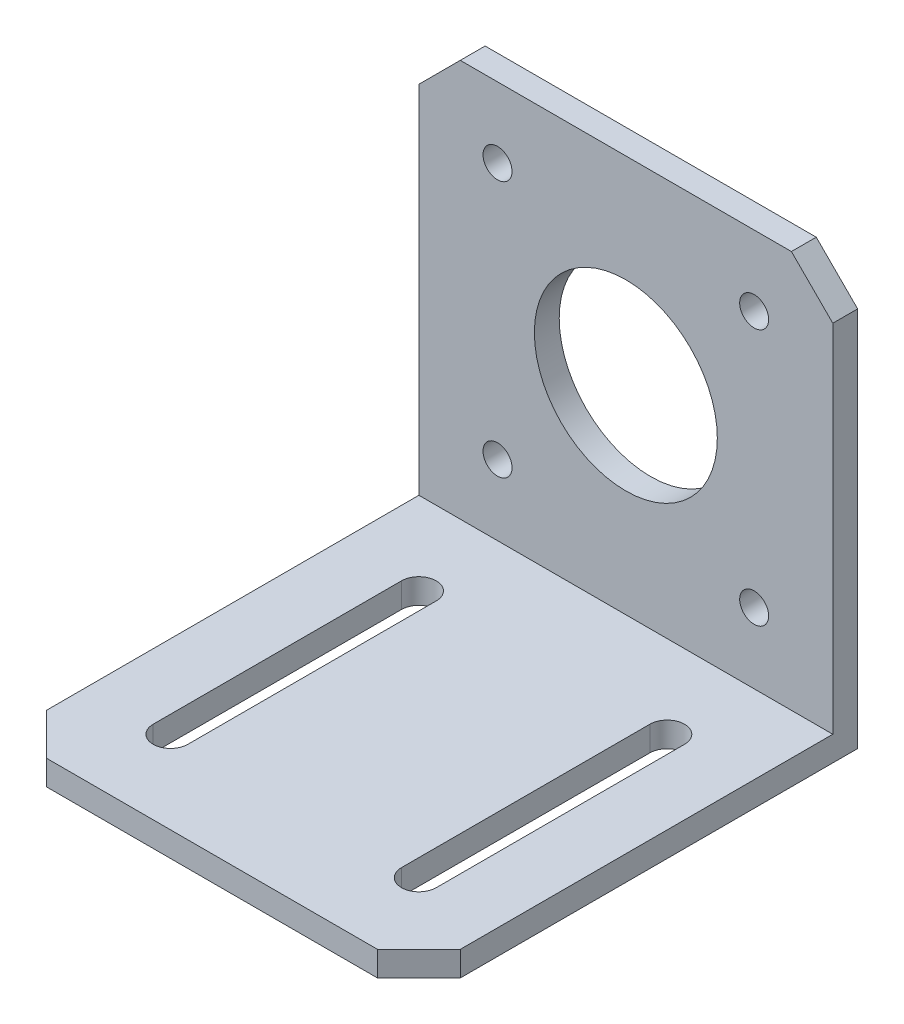
ISO-10303-21;
HEADER;
FILE_DESCRIPTION(('STEP AP214'),'2;1');
FILE_NAME('part.step','',(''),(''),'','','');
FILE_SCHEMA(('AUTOMOTIVE_DESIGN { 1 0 10303 214 1 1 1 1 }'));
ENDSEC;
DATA;
#1=APPLICATION_CONTEXT('core data for automotive mechanical design processes');
#2=APPLICATION_PROTOCOL_DEFINITION('international standard','automotive_design',2000,#1);
#3=PRODUCT_CONTEXT('',#1,'mechanical');
#4=PRODUCT('Part','Part','',(#3));
#5=PRODUCT_RELATED_PRODUCT_CATEGORY('part','',(#4));
#6=PRODUCT_DEFINITION_FORMATION('','',#4);
#7=PRODUCT_DEFINITION_CONTEXT('part definition',#1,'design');
#8=PRODUCT_DEFINITION('design','',#6,#7);
#9=PRODUCT_DEFINITION_SHAPE('','',#8);
#10=(LENGTH_UNIT() NAMED_UNIT(*) SI_UNIT(.MILLI.,.METRE.));
#11=(NAMED_UNIT(*) PLANE_ANGLE_UNIT() SI_UNIT($,.RADIAN.));
#12=(NAMED_UNIT(*) SI_UNIT($,.STERADIAN.) SOLID_ANGLE_UNIT());
#13=UNCERTAINTY_MEASURE_WITH_UNIT(LENGTH_MEASURE(1.E-05),#10,'distance_accuracy_value','');
#14=(GEOMETRIC_REPRESENTATION_CONTEXT(3) GLOBAL_UNCERTAINTY_ASSIGNED_CONTEXT((#13)) GLOBAL_UNIT_ASSIGNED_CONTEXT((#10,
#11,#12)) REPRESENTATION_CONTEXT('',''));
#15=CARTESIAN_POINT('',(0.,0.,0.));
#16=DIRECTION('',(0.,0.,1.));
#17=DIRECTION('',(1.,0.,0.));
#18=AXIS2_PLACEMENT_3D('',#15,#16,#17);
#19=CARTESIAN_POINT('',(-50.,0.,-53.));
#20=DIRECTION('',(0.,-1.,0.));
#21=DIRECTION('',(0.,0.,-1.));
#22=AXIS2_PLACEMENT_3D('',#19,#20,#21);
#23=PLANE('',#22);
#24=CARTESIAN_POINT('',(-40.,0.,-40.));
#25=DIRECTION('',(0.,-1.,0.));
#26=DIRECTION('',(0.,0.,-1.));
#27=AXIS2_PLACEMENT_3D('',#24,#25,#26);
#28=CIRCLE('',#27,2.1);
#29=CARTESIAN_POINT('',(-37.9,0.,-40.));
#30=VERTEX_POINT('',#29);
#31=CARTESIAN_POINT('',(-42.1,0.,-40.));
#32=VERTEX_POINT('',#31);
#33=EDGE_CURVE('E183',#30,#32,#28,.F.);
#34=ORIENTED_EDGE('',*,*,#33,.T.);
#35=DIRECTION('',(0.,0.,1.));
#36=VECTOR('',#35,1.);
#37=CARTESIAN_POINT('',(-42.1,0.,-40.));
#38=LINE('',#37,#36);
#39=CARTESIAN_POINT('',(-42.1,0.,-9.99999999999998));
#40=VERTEX_POINT('',#39);
#41=EDGE_CURVE('E167',#32,#40,#38,.T.);
#42=ORIENTED_EDGE('',*,*,#41,.T.);
#43=CARTESIAN_POINT('',(-40.,0.,-9.99999999999999));
#44=DIRECTION('',(0.,-1.,0.));
#45=DIRECTION('',(0.,0.,-1.));
#46=AXIS2_PLACEMENT_3D('',#43,#44,#45);
#47=CIRCLE('',#46,2.1);
#48=CARTESIAN_POINT('',(-37.9,0.,-9.99999999999998));
#49=VERTEX_POINT('',#48);
#50=EDGE_CURVE('E195',#40,#49,#47,.F.);
#51=ORIENTED_EDGE('',*,*,#50,.T.);
#52=DIRECTION('',(0.,0.,-1.));
#53=VECTOR('',#52,1.);
#54=CARTESIAN_POINT('',(-37.9,0.,-40.));
#55=LINE('',#54,#53);
#56=EDGE_CURVE('E191',#49,#30,#55,.T.);
#57=ORIENTED_EDGE('',*,*,#56,.T.);
#58=EDGE_LOOP('',(#34,#42,#51,#57));
#59=FACE_BOUND('',#58,.T.);
#60=CARTESIAN_POINT('',(-10.,0.,-40.));
#61=DIRECTION('',(0.,-1.,0.));
#62=DIRECTION('',(0.,0.,-1.));
#63=AXIS2_PLACEMENT_3D('',#60,#61,#62);
#64=CIRCLE('',#63,2.1);
#65=CARTESIAN_POINT('',(-7.90000000000001,0.,-40.));
#66=VERTEX_POINT('',#65);
#67=CARTESIAN_POINT('',(-12.1,0.,-40.));
#68=VERTEX_POINT('',#67);
#69=EDGE_CURVE('E232',#66,#68,#64,.F.);
#70=ORIENTED_EDGE('',*,*,#69,.T.);
#71=DIRECTION('',(0.,0.,1.));
#72=VECTOR('',#71,1.);
#73=CARTESIAN_POINT('',(-12.1,0.,-40.));
#74=LINE('',#73,#72);
#75=CARTESIAN_POINT('',(-12.1,0.,-9.99999999999999));
#76=VERTEX_POINT('',#75);
#77=EDGE_CURVE('E209',#68,#76,#74,.T.);
#78=ORIENTED_EDGE('',*,*,#77,.T.);
#79=CARTESIAN_POINT('',(-10.,0.,-9.99999999999999));
#80=DIRECTION('',(0.,-1.,0.));
#81=DIRECTION('',(0.,0.,-1.));
#82=AXIS2_PLACEMENT_3D('',#79,#80,#81);
#83=CIRCLE('',#82,2.1);
#84=CARTESIAN_POINT('',(-7.9,0.,-9.99999999999998));
#85=VERTEX_POINT('',#84);
#86=EDGE_CURVE('E238',#76,#85,#83,.F.);
#87=ORIENTED_EDGE('',*,*,#86,.T.);
#88=DIRECTION('',(0.,0.,-1.));
#89=VECTOR('',#88,1.);
#90=CARTESIAN_POINT('',(-7.90000000000001,0.,-40.));
#91=LINE('',#90,#89);
#92=EDGE_CURVE('E235',#85,#66,#91,.T.);
#93=ORIENTED_EDGE('',*,*,#92,.T.);
#94=EDGE_LOOP('',(#70,#78,#87,#93));
#95=FACE_BOUND('',#94,.T.);
#96=DIRECTION('',(0.,0.,-1.));
#97=VECTOR('',#96,1.);
#98=CARTESIAN_POINT('',(0.,0.,-53.));
#99=LINE('',#98,#97);
#100=CARTESIAN_POINT('',(0.,0.,-5.));
#101=VERTEX_POINT('',#100);
#102=CARTESIAN_POINT('',(0.,0.,-53.));
#103=VERTEX_POINT('',#102);
#104=EDGE_CURVE('E268',#101,#103,#99,.T.);
#105=ORIENTED_EDGE('',*,*,#104,.F.);
#106=DIRECTION('',(-0.707106781186549,0.,0.707106781186547));
#107=VECTOR('',#106,1.);
#108=CARTESIAN_POINT('',(-1.00000000000006,0.,-3.99999999999992));
#109=LINE('',#108,#107);
#110=CARTESIAN_POINT('',(-5.00000000000002,0.,0.));
#111=VERTEX_POINT('',#110);
#112=EDGE_CURVE('E330',#101,#111,#109,.T.);
#113=ORIENTED_EDGE('',*,*,#112,.T.);
#114=DIRECTION('',(1.,0.,0.));
#115=VECTOR('',#114,1.);
#116=CARTESIAN_POINT('',(-50.,0.,0.));
#117=LINE('',#116,#115);
#118=CARTESIAN_POINT('',(-45.,0.,0.));
#119=VERTEX_POINT('',#118);
#120=EDGE_CURVE('E290',#119,#111,#117,.T.);
#121=ORIENTED_EDGE('',*,*,#120,.F.);
#122=DIRECTION('',(0.707106781186547,0.,0.707106781186549));
#123=VECTOR('',#122,1.);
#124=CARTESIAN_POINT('',(-74.,0.,-29.0000000000001));
#125=LINE('',#124,#123);
#126=CARTESIAN_POINT('',(-50.,0.,-5.00000000000003));
#127=VERTEX_POINT('',#126);
#128=EDGE_CURVE('E328',#119,#127,#125,.F.);
#129=ORIENTED_EDGE('',*,*,#128,.T.);
#130=DIRECTION('',(0.,0.,-1.));
#131=VECTOR('',#130,1.);
#132=CARTESIAN_POINT('',(-50.,0.,-53.));
#133=LINE('',#132,#131);
#134=CARTESIAN_POINT('',(-50.,0.,-53.));
#135=VERTEX_POINT('',#134);
#136=EDGE_CURVE('E271',#127,#135,#133,.T.);
#137=ORIENTED_EDGE('',*,*,#136,.T.);
#138=DIRECTION('',(1.,0.,0.));
#139=VECTOR('',#138,1.);
#140=CARTESIAN_POINT('',(-50.,0.,-53.));
#141=LINE('',#140,#139);
#142=EDGE_CURVE('E281',#135,#103,#141,.T.);
#143=ORIENTED_EDGE('',*,*,#142,.T.);
#144=EDGE_LOOP('',(#105,#113,#121,#129,#137,#143));
#145=FACE_BOUND('',#144,.T.);
#146=ADVANCED_FACE('F41',(#59,#95,#145),#23,.T.);
#147=CARTESIAN_POINT('',(-50.,0.,0.));
#148=DIRECTION('',(0.,0.,1.));
#149=DIRECTION('',(1.,0.,0.));
#150=AXIS2_PLACEMENT_3D('',#147,#148,#149);
#151=PLANE('',#150);
#152=ORIENTED_EDGE('',*,*,#120,.T.);
#153=DIRECTION('',(0.,1.,0.));
#154=VECTOR('',#153,1.);
#155=CARTESIAN_POINT('',(-5.00000000000002,3.,0.));
#156=LINE('',#155,#154);
#157=CARTESIAN_POINT('',(-5.00000000000002,3.,0.));
#158=VERTEX_POINT('',#157);
#159=EDGE_CURVE('E57',#111,#158,#156,.T.);
#160=ORIENTED_EDGE('',*,*,#159,.T.);
#161=DIRECTION('',(1.,0.,0.));
#162=VECTOR('',#161,1.);
#163=CARTESIAN_POINT('',(-50.,3.,0.));
#164=LINE('',#163,#162);
#165=CARTESIAN_POINT('',(-45.,3.,0.));
#166=VERTEX_POINT('',#165);
#167=EDGE_CURVE('E293',#166,#158,#164,.T.);
#168=ORIENTED_EDGE('',*,*,#167,.F.);
#169=DIRECTION('',(0.,-1.,0.));
#170=VECTOR('',#169,1.);
#171=CARTESIAN_POINT('',(-45.,0.,0.));
#172=LINE('',#171,#170);
#173=EDGE_CURVE('E332',#166,#119,#172,.T.);
#174=ORIENTED_EDGE('',*,*,#173,.T.);
#175=EDGE_LOOP('',(#152,#160,#168,#174));
#176=FACE_BOUND('',#175,.T.);
#177=ADVANCED_FACE('F337',(#176),#151,.T.);
#178=CARTESIAN_POINT('',(-50.,3.,0.));
#179=DIRECTION('',(0.,1.,0.));
#180=DIRECTION('',(0.,0.,1.));
#181=AXIS2_PLACEMENT_3D('',#178,#179,#180);
#182=PLANE('',#181);
#183=CARTESIAN_POINT('',(-40.,3.,-40.));
#184=DIRECTION('',(0.,1.,0.));
#185=DIRECTION('',(0.,0.,1.));
#186=AXIS2_PLACEMENT_3D('',#183,#184,#185);
#187=CIRCLE('',#186,2.1);
#188=CARTESIAN_POINT('',(-37.9,3.,-40.));
#189=VERTEX_POINT('',#188);
#190=CARTESIAN_POINT('',(-42.1,3.,-40.));
#191=VERTEX_POINT('',#190);
#192=EDGE_CURVE('E186',#189,#191,#187,.T.);
#193=ORIENTED_EDGE('',*,*,#192,.F.);
#194=DIRECTION('',(0.,0.,-1.));
#195=VECTOR('',#194,1.);
#196=CARTESIAN_POINT('',(-37.9,3.,-40.));
#197=LINE('',#196,#195);
#198=CARTESIAN_POINT('',(-37.9,3.,-9.99999999999998));
#199=VERTEX_POINT('',#198);
#200=EDGE_CURVE('E187',#199,#189,#197,.T.);
#201=ORIENTED_EDGE('',*,*,#200,.F.);
#202=CARTESIAN_POINT('',(-40.,3.,-9.99999999999999));
#203=DIRECTION('',(0.,1.,0.));
#204=DIRECTION('',(0.,0.,1.));
#205=AXIS2_PLACEMENT_3D('',#202,#203,#204);
#206=CIRCLE('',#205,2.1);
#207=CARTESIAN_POINT('',(-42.1,3.,-9.99999999999998));
#208=VERTEX_POINT('',#207);
#209=EDGE_CURVE('E200',#208,#199,#206,.T.);
#210=ORIENTED_EDGE('',*,*,#209,.F.);
#211=DIRECTION('',(0.,0.,1.));
#212=VECTOR('',#211,1.);
#213=CARTESIAN_POINT('',(-42.1,3.,-40.));
#214=LINE('',#213,#212);
#215=EDGE_CURVE('E193',#191,#208,#214,.T.);
#216=ORIENTED_EDGE('',*,*,#215,.F.);
#217=EDGE_LOOP('',(#193,#201,#210,#216));
#218=FACE_BOUND('',#217,.T.);
#219=CARTESIAN_POINT('',(-10.,3.,-40.));
#220=DIRECTION('',(0.,1.,0.));
#221=DIRECTION('',(0.,0.,-1.));
#222=AXIS2_PLACEMENT_3D('',#219,#220,#221);
#223=CIRCLE('',#222,2.1);
#224=CARTESIAN_POINT('',(-7.90000000000001,3.,-40.));
#225=VERTEX_POINT('',#224);
#226=CARTESIAN_POINT('',(-12.1,3.,-40.));
#227=VERTEX_POINT('',#226);
#228=EDGE_CURVE('E230',#225,#227,#223,.T.);
#229=ORIENTED_EDGE('',*,*,#228,.F.);
#230=DIRECTION('',(0.,0.,-1.));
#231=VECTOR('',#230,1.);
#232=CARTESIAN_POINT('',(-7.90000000000001,3.,-40.));
#233=LINE('',#232,#231);
#234=CARTESIAN_POINT('',(-7.9,3.,-9.99999999999998));
#235=VERTEX_POINT('',#234);
#236=EDGE_CURVE('E216',#235,#225,#233,.T.);
#237=ORIENTED_EDGE('',*,*,#236,.F.);
#238=CARTESIAN_POINT('',(-10.,3.,-9.99999999999999));
#239=DIRECTION('',(0.,1.,0.));
#240=DIRECTION('',(0.,0.,-1.));
#241=AXIS2_PLACEMENT_3D('',#238,#239,#240);
#242=CIRCLE('',#241,2.1);
#243=CARTESIAN_POINT('',(-12.1,3.,-9.99999999999998));
#244=VERTEX_POINT('',#243);
#245=EDGE_CURVE('E224',#244,#235,#242,.T.);
#246=ORIENTED_EDGE('',*,*,#245,.F.);
#247=DIRECTION('',(0.,0.,1.));
#248=VECTOR('',#247,1.);
#249=CARTESIAN_POINT('',(-12.1,3.,-40.));
#250=LINE('',#249,#248);
#251=EDGE_CURVE('E227',#227,#244,#250,.T.);
#252=ORIENTED_EDGE('',*,*,#251,.F.);
#253=EDGE_LOOP('',(#229,#237,#246,#252));
#254=FACE_BOUND('',#253,.T.);
#255=ORIENTED_EDGE('',*,*,#167,.T.);
#256=DIRECTION('',(0.707106781186549,0.,-0.707106781186547));
#257=VECTOR('',#256,1.);
#258=CARTESIAN_POINT('',(-27.5000000000001,3.,22.5));
#259=LINE('',#258,#257);
#260=CARTESIAN_POINT('',(0.,3.,-5.));
#261=VERTEX_POINT('',#260);
#262=EDGE_CURVE('E11',#158,#261,#259,.T.);
#263=ORIENTED_EDGE('',*,*,#262,.T.);
#264=DIRECTION('',(0.,0.,1.));
#265=VECTOR('',#264,1.);
#266=CARTESIAN_POINT('',(0.,3.,0.));
#267=LINE('',#266,#265);
#268=CARTESIAN_POINT('',(0.,3.,-50.));
#269=VERTEX_POINT('',#268);
#270=EDGE_CURVE('E274',#269,#261,#267,.T.);
#271=ORIENTED_EDGE('',*,*,#270,.F.);
#272=DIRECTION('',(1.,0.,0.));
#273=VECTOR('',#272,1.);
#274=CARTESIAN_POINT('',(-50.,3.,-50.));
#275=LINE('',#274,#273);
#276=CARTESIAN_POINT('',(-50.,3.,-50.));
#277=VERTEX_POINT('',#276);
#278=EDGE_CURVE('E295',#277,#269,#275,.T.);
#279=ORIENTED_EDGE('',*,*,#278,.F.);
#280=DIRECTION('',(0.,0.,1.));
#281=VECTOR('',#280,1.);
#282=CARTESIAN_POINT('',(-50.,3.,0.));
#283=LINE('',#282,#281);
#284=CARTESIAN_POINT('',(-50.,3.,-5.00000000000003));
#285=VERTEX_POINT('',#284);
#286=EDGE_CURVE('E279',#277,#285,#283,.T.);
#287=ORIENTED_EDGE('',*,*,#286,.T.);
#288=DIRECTION('',(-0.707106781186547,0.,-0.707106781186549));
#289=VECTOR('',#288,1.);
#290=CARTESIAN_POINT('',(-47.5,3.,-2.50000000000001));
#291=LINE('',#290,#289);
#292=EDGE_CURVE('E50',#285,#166,#291,.F.);
#293=ORIENTED_EDGE('',*,*,#292,.T.);
#294=EDGE_LOOP('',(#255,#263,#271,#279,#287,#293));
#295=FACE_BOUND('',#294,.T.);
#296=ADVANCED_FACE('F351',(#218,#254,#295),#182,.T.);
#297=CARTESIAN_POINT('',(-50.,3.,-50.));
#298=DIRECTION('',(0.,0.,1.));
#299=DIRECTION('',(0.,-1.,0.));
#300=AXIS2_PLACEMENT_3D('',#297,#298,#299);
#301=PLANE('',#300);
#302=CARTESIAN_POINT('',(-40.5,11.5,-50.));
#303=DIRECTION('',(0.,0.,1.));
#304=DIRECTION('',(-1.,0.,0.));
#305=AXIS2_PLACEMENT_3D('',#302,#303,#304);
#306=CIRCLE('',#305,1.75);
#307=CARTESIAN_POINT('',(-42.25,11.5,-50.));
#308=VERTEX_POINT('',#307);
#309=EDGE_CURVE('E178',#308,#308,#306,.T.);
#310=ORIENTED_EDGE('',*,*,#309,.F.);
#311=EDGE_LOOP('',(#310));
#312=FACE_BOUND('',#311,.T.);
#313=CARTESIAN_POINT('',(-9.50000000000001,11.5,-50.));
#314=DIRECTION('',(0.,0.,1.));
#315=DIRECTION('',(1.,0.,0.));
#316=AXIS2_PLACEMENT_3D('',#313,#314,#315);
#317=CIRCLE('',#316,1.75);
#318=CARTESIAN_POINT('',(-7.75000000000001,11.5,-50.));
#319=VERTEX_POINT('',#318);
#320=EDGE_CURVE('E257',#319,#319,#317,.T.);
#321=ORIENTED_EDGE('',*,*,#320,.F.);
#322=EDGE_LOOP('',(#321));
#323=FACE_BOUND('',#322,.T.);
#324=CARTESIAN_POINT('',(-9.50000000000001,42.5,-50.));
#325=DIRECTION('',(0.,0.,1.));
#326=DIRECTION('',(-1.,0.,0.));
#327=AXIS2_PLACEMENT_3D('',#324,#325,#326);
#328=CIRCLE('',#327,1.75);
#329=CARTESIAN_POINT('',(-11.25,42.5,-50.));
#330=VERTEX_POINT('',#329);
#331=EDGE_CURVE('E251',#330,#330,#328,.T.);
#332=ORIENTED_EDGE('',*,*,#331,.F.);
#333=EDGE_LOOP('',(#332));
#334=FACE_BOUND('',#333,.T.);
#335=CARTESIAN_POINT('',(-40.5,42.5,-50.));
#336=DIRECTION('',(0.,0.,1.));
#337=DIRECTION('',(1.,0.,0.));
#338=AXIS2_PLACEMENT_3D('',#335,#336,#337);
#339=CIRCLE('',#338,1.75);
#340=CARTESIAN_POINT('',(-38.75,42.5,-50.));
#341=VERTEX_POINT('',#340);
#342=EDGE_CURVE('E245',#341,#341,#339,.T.);
#343=ORIENTED_EDGE('',*,*,#342,.F.);
#344=EDGE_LOOP('',(#343));
#345=FACE_BOUND('',#344,.T.);
#346=CARTESIAN_POINT('',(-25.,27.,-50.));
#347=DIRECTION('',(0.,0.,1.));
#348=DIRECTION('',(1.,0.,0.));
#349=AXIS2_PLACEMENT_3D('',#346,#347,#348);
#350=CIRCLE('',#349,11.05);
#351=CARTESIAN_POINT('',(-13.95,27.,-50.));
#352=VERTEX_POINT('',#351);
#353=EDGE_CURVE('E265',#352,#352,#350,.T.);
#354=ORIENTED_EDGE('',*,*,#353,.F.);
#355=EDGE_LOOP('',(#354));
#356=FACE_BOUND('',#355,.T.);
#357=DIRECTION('',(1.,0.,0.));
#358=VECTOR('',#357,1.);
#359=CARTESIAN_POINT('',(-50.,51.,-50.));
#360=LINE('',#359,#358);
#361=CARTESIAN_POINT('',(-45.,51.,-50.));
#362=VERTEX_POINT('',#361);
#363=CARTESIAN_POINT('',(-5.00000000000002,51.,-50.));
#364=VERTEX_POINT('',#363);
#365=EDGE_CURVE('E298',#362,#364,#360,.T.);
#366=ORIENTED_EDGE('',*,*,#365,.F.);
#367=DIRECTION('',(0.707106781186547,0.707106781186549,0.));
#368=VECTOR('',#367,1.);
#369=CARTESIAN_POINT('',(-71.5,24.4999999999999,-50.));
#370=LINE('',#369,#368);
#371=CARTESIAN_POINT('',(-50.,46.,-50.));
#372=VERTEX_POINT('',#371);
#373=EDGE_CURVE('E312',#362,#372,#370,.F.);
#374=ORIENTED_EDGE('',*,*,#373,.T.);
#375=DIRECTION('',(0.,-1.,0.));
#376=VECTOR('',#375,1.);
#377=CARTESIAN_POINT('',(-50.,3.,-50.));
#378=LINE('',#377,#376);
#379=EDGE_CURVE('E277',#372,#277,#378,.T.);
#380=ORIENTED_EDGE('',*,*,#379,.T.);
#381=ORIENTED_EDGE('',*,*,#278,.T.);
#382=DIRECTION('',(0.,-1.,0.));
#383=VECTOR('',#382,1.);
#384=CARTESIAN_POINT('',(0.,3.,-50.));
#385=LINE('',#384,#383);
#386=CARTESIAN_POINT('',(0.,46.,-50.));
#387=VERTEX_POINT('',#386);
#388=EDGE_CURVE('E286',#387,#269,#385,.T.);
#389=ORIENTED_EDGE('',*,*,#388,.F.);
#390=DIRECTION('',(-0.707106781186549,0.707106781186547,0.));
#391=VECTOR('',#390,1.);
#392=CARTESIAN_POINT('',(-3.50000000000007,49.5000000000001,-50.));
#393=LINE('',#392,#391);
#394=EDGE_CURVE('E310',#387,#364,#393,.T.);
#395=ORIENTED_EDGE('',*,*,#394,.T.);
#396=EDGE_LOOP('',(#366,#374,#380,#381,#389,#395));
#397=FACE_BOUND('',#396,.T.);
#398=ADVANCED_FACE('F403',(#312,#323,#334,#345,#356,#397),#301,.T.);
#399=CARTESIAN_POINT('',(-50.,51.,-50.));
#400=DIRECTION('',(0.,1.,0.));
#401=DIRECTION('',(0.,0.,1.));
#402=AXIS2_PLACEMENT_3D('',#399,#400,#401);
#403=PLANE('',#402);
#404=DIRECTION('',(1.,0.,0.));
#405=VECTOR('',#404,1.);
#406=CARTESIAN_POINT('',(-50.,51.,-53.));
#407=LINE('',#406,#405);
#408=CARTESIAN_POINT('',(-45.,51.,-53.));
#409=VERTEX_POINT('',#408);
#410=CARTESIAN_POINT('',(-5.00000000000002,51.,-53.));
#411=VERTEX_POINT('',#410);
#412=EDGE_CURVE('E301',#409,#411,#407,.T.);
#413=ORIENTED_EDGE('',*,*,#412,.F.);
#414=DIRECTION('',(0.,0.,1.));
#415=VECTOR('',#414,1.);
#416=CARTESIAN_POINT('',(-45.,51.,-50.));
#417=LINE('',#416,#415);
#418=EDGE_CURVE('E307',#409,#362,#417,.T.);
#419=ORIENTED_EDGE('',*,*,#418,.T.);
#420=ORIENTED_EDGE('',*,*,#365,.T.);
#421=DIRECTION('',(0.,0.,-1.));
#422=VECTOR('',#421,1.);
#423=CARTESIAN_POINT('',(-5.00000000000002,51.,-53.));
#424=LINE('',#423,#422);
#425=EDGE_CURVE('E292',#364,#411,#424,.T.);
#426=ORIENTED_EDGE('',*,*,#425,.T.);
#427=EDGE_LOOP('',(#413,#419,#420,#426));
#428=FACE_BOUND('',#427,.T.);
#429=ADVANCED_FACE('F405',(#428),#403,.T.);
#430=CARTESIAN_POINT('',(-50.,51.,-53.));
#431=DIRECTION('',(0.,0.,-1.));
#432=DIRECTION('',(-1.,0.,0.));
#433=AXIS2_PLACEMENT_3D('',#430,#431,#432);
#434=PLANE('',#433);
#435=CARTESIAN_POINT('',(-40.5,11.5,-53.));
#436=DIRECTION('',(0.,0.,-1.));
#437=DIRECTION('',(-1.,0.,0.));
#438=AXIS2_PLACEMENT_3D('',#435,#436,#437);
#439=CIRCLE('',#438,1.75);
#440=CARTESIAN_POINT('',(-42.25,11.5,-53.));
#441=VERTEX_POINT('',#440);
#442=EDGE_CURVE('E260',#441,#441,#439,.F.);
#443=ORIENTED_EDGE('',*,*,#442,.T.);
#444=EDGE_LOOP('',(#443));
#445=FACE_BOUND('',#444,.T.);
#446=CARTESIAN_POINT('',(-9.50000000000001,11.5,-53.));
#447=DIRECTION('',(0.,0.,-1.));
#448=DIRECTION('',(-1.,0.,0.));
#449=AXIS2_PLACEMENT_3D('',#446,#447,#448);
#450=CIRCLE('',#449,1.75);
#451=CARTESIAN_POINT('',(-11.25,11.5,-53.));
#452=VERTEX_POINT('',#451);
#453=EDGE_CURVE('E254',#452,#452,#450,.F.);
#454=ORIENTED_EDGE('',*,*,#453,.T.);
#455=EDGE_LOOP('',(#454));
#456=FACE_BOUND('',#455,.T.);
#457=CARTESIAN_POINT('',(-9.50000000000001,42.5,-53.));
#458=DIRECTION('',(0.,0.,-1.));
#459=DIRECTION('',(-1.,0.,0.));
#460=AXIS2_PLACEMENT_3D('',#457,#458,#459);
#461=CIRCLE('',#460,1.75);
#462=CARTESIAN_POINT('',(-11.25,42.5,-53.));
#463=VERTEX_POINT('',#462);
#464=EDGE_CURVE('E248',#463,#463,#461,.F.);
#465=ORIENTED_EDGE('',*,*,#464,.T.);
#466=EDGE_LOOP('',(#465));
#467=FACE_BOUND('',#466,.T.);
#468=CARTESIAN_POINT('',(-40.5,42.5,-53.));
#469=DIRECTION('',(0.,0.,-1.));
#470=DIRECTION('',(-1.,0.,0.));
#471=AXIS2_PLACEMENT_3D('',#468,#469,#470);
#472=CIRCLE('',#471,1.75);
#473=CARTESIAN_POINT('',(-42.25,42.5,-53.));
#474=VERTEX_POINT('',#473);
#475=EDGE_CURVE('E241',#474,#474,#472,.F.);
#476=ORIENTED_EDGE('',*,*,#475,.T.);
#477=EDGE_LOOP('',(#476));
#478=FACE_BOUND('',#477,.T.);
#479=CARTESIAN_POINT('',(-25.,27.,-53.));
#480=DIRECTION('',(0.,0.,-1.));
#481=DIRECTION('',(-1.,0.,0.));
#482=AXIS2_PLACEMENT_3D('',#479,#480,#481);
#483=CIRCLE('',#482,11.05);
#484=CARTESIAN_POINT('',(-36.05,27.,-53.));
#485=VERTEX_POINT('',#484);
#486=EDGE_CURVE('E244',#485,#485,#483,.F.);
#487=ORIENTED_EDGE('',*,*,#486,.T.);
#488=EDGE_LOOP('',(#487));
#489=FACE_BOUND('',#488,.T.);
#490=DIRECTION('',(0.,1.,0.));
#491=VECTOR('',#490,1.);
#492=CARTESIAN_POINT('',(-50.,51.,-53.));
#493=LINE('',#492,#491);
#494=CARTESIAN_POINT('',(-50.,46.,-53.));
#495=VERTEX_POINT('',#494);
#496=EDGE_CURVE('E273',#135,#495,#493,.T.);
#497=ORIENTED_EDGE('',*,*,#496,.T.);
#498=DIRECTION('',(-0.707106781186547,-0.707106781186549,0.));
#499=VECTOR('',#498,1.);
#500=CARTESIAN_POINT('',(-47.5,48.5,-53.));
#501=LINE('',#500,#499);
#502=EDGE_CURVE('E320',#495,#409,#501,.F.);
#503=ORIENTED_EDGE('',*,*,#502,.T.);
#504=ORIENTED_EDGE('',*,*,#412,.T.);
#505=DIRECTION('',(0.707106781186549,-0.707106781186547,0.));
#506=VECTOR('',#505,1.);
#507=CARTESIAN_POINT('',(-27.5000000000001,73.5,-53.));
#508=LINE('',#507,#506);
#509=CARTESIAN_POINT('',(0.,46.,-53.));
#510=VERTEX_POINT('',#509);
#511=EDGE_CURVE('E318',#411,#510,#508,.T.);
#512=ORIENTED_EDGE('',*,*,#511,.T.);
#513=DIRECTION('',(0.,1.,0.));
#514=VECTOR('',#513,1.);
#515=CARTESIAN_POINT('',(0.,51.,-53.));
#516=LINE('',#515,#514);
#517=EDGE_CURVE('E283',#103,#510,#516,.T.);
#518=ORIENTED_EDGE('',*,*,#517,.F.);
#519=ORIENTED_EDGE('',*,*,#142,.F.);
#520=EDGE_LOOP('',(#497,#503,#504,#512,#518,#519));
#521=FACE_BOUND('',#520,.T.);
#522=ADVANCED_FACE('F374',(#445,#456,#467,#478,#489,#521),#434,.T.);
#523=CARTESIAN_POINT('',(-50.,0.,0.));
#524=DIRECTION('',(-1.,0.,0.));
#525=DIRECTION('',(0.,0.,1.));
#526=AXIS2_PLACEMENT_3D('',#523,#524,#525);
#527=PLANE('',#526);
#528=ORIENTED_EDGE('',*,*,#379,.F.);
#529=DIRECTION('',(0.,0.,-1.));
#530=VECTOR('',#529,1.);
#531=CARTESIAN_POINT('',(-50.,46.,0.));
#532=LINE('',#531,#530);
#533=EDGE_CURVE('E316',#372,#495,#532,.T.);
#534=ORIENTED_EDGE('',*,*,#533,.T.);
#535=ORIENTED_EDGE('',*,*,#496,.F.);
#536=ORIENTED_EDGE('',*,*,#136,.F.);
#537=DIRECTION('',(0.,1.,0.));
#538=VECTOR('',#537,1.);
#539=CARTESIAN_POINT('',(-50.,0.,-5.00000000000003));
#540=LINE('',#539,#538);
#541=EDGE_CURVE('E314',#127,#285,#540,.T.);
#542=ORIENTED_EDGE('',*,*,#541,.T.);
#543=ORIENTED_EDGE('',*,*,#286,.F.);
#544=EDGE_LOOP('',(#528,#534,#535,#536,#542,#543));
#545=FACE_BOUND('',#544,.T.);
#546=ADVANCED_FACE('F356',(#545),#527,.T.);
#547=CARTESIAN_POINT('',(0.,0.,0.));
#548=DIRECTION('',(-1.,0.,0.));
#549=DIRECTION('',(0.,0.,1.));
#550=AXIS2_PLACEMENT_3D('',#547,#548,#549);
#551=PLANE('',#550);
#552=ORIENTED_EDGE('',*,*,#517,.T.);
#553=DIRECTION('',(0.,0.,1.));
#554=VECTOR('',#553,1.);
#555=CARTESIAN_POINT('',(0.,46.,-50.));
#556=LINE('',#555,#554);
#557=EDGE_CURVE('E325',#510,#387,#556,.T.);
#558=ORIENTED_EDGE('',*,*,#557,.T.);
#559=ORIENTED_EDGE('',*,*,#388,.T.);
#560=ORIENTED_EDGE('',*,*,#270,.T.);
#561=DIRECTION('',(0.,-1.,0.));
#562=VECTOR('',#561,1.);
#563=CARTESIAN_POINT('',(0.,0.,-5.));
#564=LINE('',#563,#562);
#565=EDGE_CURVE('E322',#261,#101,#564,.T.);
#566=ORIENTED_EDGE('',*,*,#565,.T.);
#567=ORIENTED_EDGE('',*,*,#104,.T.);
#568=EDGE_LOOP('',(#552,#558,#559,#560,#566,#567));
#569=FACE_BOUND('',#568,.T.);
#570=ADVANCED_FACE('F347',(#569),#551,.F.);
#571=CARTESIAN_POINT('',(-25.,27.,-53.001));
#572=DIRECTION('',(0.,0.,1.));
#573=DIRECTION('',(1.,0.,0.));
#574=AXIS2_PLACEMENT_3D('',#571,#572,#573);
#575=CYLINDRICAL_SURFACE('',#574,11.05);
#576=ORIENTED_EDGE('',*,*,#486,.F.);
#577=EDGE_LOOP('',(#576));
#578=FACE_BOUND('',#577,.T.);
#579=ORIENTED_EDGE('',*,*,#353,.T.);
#580=EDGE_LOOP('',(#579));
#581=FACE_BOUND('',#580,.T.);
#582=ADVANCED_FACE('F422',(#578,#581),#575,.F.);
#583=CARTESIAN_POINT('',(-40.5,42.5,-53.001));
#584=DIRECTION('',(0.,0.,1.));
#585=DIRECTION('',(1.,0.,0.));
#586=AXIS2_PLACEMENT_3D('',#583,#584,#585);
#587=CYLINDRICAL_SURFACE('',#586,1.75);
#588=ORIENTED_EDGE('',*,*,#475,.F.);
#589=EDGE_LOOP('',(#588));
#590=FACE_BOUND('',#589,.T.);
#591=ORIENTED_EDGE('',*,*,#342,.T.);
#592=EDGE_LOOP('',(#591));
#593=FACE_BOUND('',#592,.T.);
#594=ADVANCED_FACE('F427',(#590,#593),#587,.F.);
#595=CARTESIAN_POINT('',(-9.50000000000001,42.5,-53.001));
#596=DIRECTION('',(0.,0.,1.));
#597=DIRECTION('',(1.,0.,0.));
#598=AXIS2_PLACEMENT_3D('',#595,#596,#597);
#599=CYLINDRICAL_SURFACE('',#598,1.75);
#600=ORIENTED_EDGE('',*,*,#464,.F.);
#601=EDGE_LOOP('',(#600));
#602=FACE_BOUND('',#601,.T.);
#603=ORIENTED_EDGE('',*,*,#331,.T.);
#604=EDGE_LOOP('',(#603));
#605=FACE_BOUND('',#604,.T.);
#606=ADVANCED_FACE('F437',(#602,#605),#599,.F.);
#607=CARTESIAN_POINT('',(-9.50000000000001,11.5,-53.001));
#608=DIRECTION('',(0.,0.,1.));
#609=DIRECTION('',(1.,0.,0.));
#610=AXIS2_PLACEMENT_3D('',#607,#608,#609);
#611=CYLINDRICAL_SURFACE('',#610,1.75);
#612=ORIENTED_EDGE('',*,*,#453,.F.);
#613=EDGE_LOOP('',(#612));
#614=FACE_BOUND('',#613,.T.);
#615=ORIENTED_EDGE('',*,*,#320,.T.);
#616=EDGE_LOOP('',(#615));
#617=FACE_BOUND('',#616,.T.);
#618=ADVANCED_FACE('F433',(#614,#617),#611,.F.);
#619=CARTESIAN_POINT('',(-40.5,11.5,-53.001));
#620=DIRECTION('',(0.,0.,1.));
#621=DIRECTION('',(1.,0.,0.));
#622=AXIS2_PLACEMENT_3D('',#619,#620,#621);
#623=CYLINDRICAL_SURFACE('',#622,1.75);
#624=ORIENTED_EDGE('',*,*,#442,.F.);
#625=EDGE_LOOP('',(#624));
#626=FACE_BOUND('',#625,.T.);
#627=ORIENTED_EDGE('',*,*,#309,.T.);
#628=EDGE_LOOP('',(#627));
#629=FACE_BOUND('',#628,.T.);
#630=ADVANCED_FACE('F429',(#626,#629),#623,.F.);
#631=CARTESIAN_POINT('',(-10.,-0.00100000000000013,-40.));
#632=DIRECTION('',(0.,1.,0.));
#633=DIRECTION('',(0.,0.,1.));
#634=AXIS2_PLACEMENT_3D('',#631,#632,#633);
#635=CYLINDRICAL_SURFACE('',#634,2.1);
#636=DIRECTION('',(0.,1.,0.));
#637=VECTOR('',#636,1.);
#638=CARTESIAN_POINT('',(-7.90000000000001,-0.00100000000000013,-40.));
#639=LINE('',#638,#637);
#640=EDGE_CURVE('E212',#66,#225,#639,.T.);
#641=ORIENTED_EDGE('',*,*,#640,.T.);
#642=ORIENTED_EDGE('',*,*,#228,.T.);
#643=DIRECTION('',(0.,1.,0.));
#644=VECTOR('',#643,1.);
#645=CARTESIAN_POINT('',(-12.1,-0.00100000000000013,-40.));
#646=LINE('',#645,#644);
#647=EDGE_CURVE('E213',#68,#227,#646,.T.);
#648=ORIENTED_EDGE('',*,*,#647,.F.);
#649=ORIENTED_EDGE('',*,*,#69,.F.);
#650=EDGE_LOOP('',(#641,#642,#648,#649));
#651=FACE_BOUND('',#650,.T.);
#652=ADVANCED_FACE('F432',(#651),#635,.F.);
#653=CARTESIAN_POINT('',(-7.90000000000001,-0.00100000000000013,-40.));
#654=DIRECTION('',(1.,0.,0.));
#655=DIRECTION('',(0.,0.,-1.));
#656=AXIS2_PLACEMENT_3D('',#653,#654,#655);
#657=PLANE('',#656);
#658=DIRECTION('',(0.,1.,0.));
#659=VECTOR('',#658,1.);
#660=CARTESIAN_POINT('',(-7.9,-0.00100000000000013,-9.99999999999998));
#661=LINE('',#660,#659);
#662=EDGE_CURVE('E219',#85,#235,#661,.T.);
#663=ORIENTED_EDGE('',*,*,#662,.T.);
#664=ORIENTED_EDGE('',*,*,#236,.T.);
#665=ORIENTED_EDGE('',*,*,#640,.F.);
#666=ORIENTED_EDGE('',*,*,#92,.F.);
#667=EDGE_LOOP('',(#663,#664,#665,#666));
#668=FACE_BOUND('',#667,.T.);
#669=ADVANCED_FACE('F445',(#668),#657,.F.);
#670=CARTESIAN_POINT('',(-10.,-0.00100000000000013,-9.99999999999999));
#671=DIRECTION('',(0.,1.,0.));
#672=DIRECTION('',(0.,0.,1.));
#673=AXIS2_PLACEMENT_3D('',#670,#671,#672);
#674=CYLINDRICAL_SURFACE('',#673,2.1);
#675=DIRECTION('',(0.,1.,0.));
#676=VECTOR('',#675,1.);
#677=CARTESIAN_POINT('',(-12.1,-0.00100000000000013,-9.99999999999998));
#678=LINE('',#677,#676);
#679=EDGE_CURVE('E217',#76,#244,#678,.T.);
#680=ORIENTED_EDGE('',*,*,#679,.T.);
#681=ORIENTED_EDGE('',*,*,#245,.T.);
#682=ORIENTED_EDGE('',*,*,#662,.F.);
#683=ORIENTED_EDGE('',*,*,#86,.F.);
#684=EDGE_LOOP('',(#680,#681,#682,#683));
#685=FACE_BOUND('',#684,.T.);
#686=ADVANCED_FACE('F448',(#685),#674,.F.);
#687=CARTESIAN_POINT('',(-12.1,-0.00100000000000013,-40.));
#688=DIRECTION('',(-1.,0.,0.));
#689=DIRECTION('',(0.,0.,1.));
#690=AXIS2_PLACEMENT_3D('',#687,#688,#689);
#691=PLANE('',#690);
#692=ORIENTED_EDGE('',*,*,#647,.T.);
#693=ORIENTED_EDGE('',*,*,#251,.T.);
#694=ORIENTED_EDGE('',*,*,#679,.F.);
#695=ORIENTED_EDGE('',*,*,#77,.F.);
#696=EDGE_LOOP('',(#692,#693,#694,#695));
#697=FACE_BOUND('',#696,.T.);
#698=ADVANCED_FACE('F452',(#697),#691,.F.);
#699=CARTESIAN_POINT('',(-40.,-0.00100000000000013,-40.));
#700=DIRECTION('',(0.,1.,0.));
#701=DIRECTION('',(0.,0.,1.));
#702=AXIS2_PLACEMENT_3D('',#699,#700,#701);
#703=CYLINDRICAL_SURFACE('',#702,2.1);
#704=DIRECTION('',(0.,1.,0.));
#705=VECTOR('',#704,1.);
#706=CARTESIAN_POINT('',(-37.9,-0.00100000000000013,-40.));
#707=LINE('',#706,#705);
#708=EDGE_CURVE('E179',#30,#189,#707,.T.);
#709=ORIENTED_EDGE('',*,*,#708,.T.);
#710=ORIENTED_EDGE('',*,*,#192,.T.);
#711=DIRECTION('',(0.,1.,0.));
#712=VECTOR('',#711,1.);
#713=CARTESIAN_POINT('',(-42.1,-0.00100000000000013,-40.));
#714=LINE('',#713,#712);
#715=EDGE_CURVE('E171',#32,#191,#714,.T.);
#716=ORIENTED_EDGE('',*,*,#715,.F.);
#717=ORIENTED_EDGE('',*,*,#33,.F.);
#718=EDGE_LOOP('',(#709,#710,#716,#717));
#719=FACE_BOUND('',#718,.T.);
#720=ADVANCED_FACE('F182',(#719),#703,.F.);
#721=CARTESIAN_POINT('',(-37.9,-0.00100000000000013,-40.));
#722=DIRECTION('',(1.,0.,0.));
#723=DIRECTION('',(0.,0.,-1.));
#724=AXIS2_PLACEMENT_3D('',#721,#722,#723);
#725=PLANE('',#724);
#726=DIRECTION('',(0.,1.,0.));
#727=VECTOR('',#726,1.);
#728=CARTESIAN_POINT('',(-37.9,-0.00100000000000013,-9.99999999999998));
#729=LINE('',#728,#727);
#730=EDGE_CURVE('E206',#49,#199,#729,.T.);
#731=ORIENTED_EDGE('',*,*,#730,.T.);
#732=ORIENTED_EDGE('',*,*,#200,.T.);
#733=ORIENTED_EDGE('',*,*,#708,.F.);
#734=ORIENTED_EDGE('',*,*,#56,.F.);
#735=EDGE_LOOP('',(#731,#732,#733,#734));
#736=FACE_BOUND('',#735,.T.);
#737=ADVANCED_FACE('F462',(#736),#725,.F.);
#738=CARTESIAN_POINT('',(-40.,-0.00100000000000013,-9.99999999999999));
#739=DIRECTION('',(0.,1.,0.));
#740=DIRECTION('',(0.,0.,1.));
#741=AXIS2_PLACEMENT_3D('',#738,#739,#740);
#742=CYLINDRICAL_SURFACE('',#741,2.1);
#743=DIRECTION('',(0.,1.,0.));
#744=VECTOR('',#743,1.);
#745=CARTESIAN_POINT('',(-42.1,-0.00100000000000013,-9.99999999999998));
#746=LINE('',#745,#744);
#747=EDGE_CURVE('E173',#40,#208,#746,.T.);
#748=ORIENTED_EDGE('',*,*,#747,.T.);
#749=ORIENTED_EDGE('',*,*,#209,.T.);
#750=ORIENTED_EDGE('',*,*,#730,.F.);
#751=ORIENTED_EDGE('',*,*,#50,.F.);
#752=EDGE_LOOP('',(#748,#749,#750,#751));
#753=FACE_BOUND('',#752,.T.);
#754=ADVANCED_FACE('F464',(#753),#742,.F.);
#755=CARTESIAN_POINT('',(-42.1,-0.00100000000000013,-40.));
#756=DIRECTION('',(-1.,0.,0.));
#757=DIRECTION('',(0.,0.,1.));
#758=AXIS2_PLACEMENT_3D('',#755,#756,#757);
#759=PLANE('',#758);
#760=ORIENTED_EDGE('',*,*,#715,.T.);
#761=ORIENTED_EDGE('',*,*,#215,.T.);
#762=ORIENTED_EDGE('',*,*,#747,.F.);
#763=ORIENTED_EDGE('',*,*,#41,.F.);
#764=EDGE_LOOP('',(#760,#761,#762,#763));
#765=FACE_BOUND('',#764,.T.);
#766=ADVANCED_FACE('F169',(#765),#759,.F.);
#767=CARTESIAN_POINT('',(-45.,51.,-50.));
#768=DIRECTION('',(0.707106781186548,-0.707106781186546,0.));
#769=DIRECTION('',(0.,0.,1.));
#770=AXIS2_PLACEMENT_3D('',#767,#768,#769);
#771=PLANE('',#770);
#772=ORIENTED_EDGE('',*,*,#502,.F.);
#773=ORIENTED_EDGE('',*,*,#533,.F.);
#774=ORIENTED_EDGE('',*,*,#373,.F.);
#775=ORIENTED_EDGE('',*,*,#418,.F.);
#776=EDGE_LOOP('',(#772,#773,#774,#775));
#777=FACE_BOUND('',#776,.T.);
#778=ADVANCED_FACE('F377',(#777),#771,.F.);
#779=CARTESIAN_POINT('',(0.,46.,0.));
#780=DIRECTION('',(0.707106781186547,0.707106781186549,0.));
#781=DIRECTION('',(0.,0.,-1.));
#782=AXIS2_PLACEMENT_3D('',#779,#780,#781);
#783=PLANE('',#782);
#784=ORIENTED_EDGE('',*,*,#511,.F.);
#785=ORIENTED_EDGE('',*,*,#425,.F.);
#786=ORIENTED_EDGE('',*,*,#394,.F.);
#787=ORIENTED_EDGE('',*,*,#557,.F.);
#788=EDGE_LOOP('',(#784,#785,#786,#787));
#789=FACE_BOUND('',#788,.T.);
#790=ADVANCED_FACE('F364',(#789),#783,.T.);
#791=CARTESIAN_POINT('',(0.,0.,-5.));
#792=DIRECTION('',(0.707106781186547,0.,0.707106781186549));
#793=DIRECTION('',(0.,1.,0.));
#794=AXIS2_PLACEMENT_3D('',#791,#792,#793);
#795=PLANE('',#794);
#796=ORIENTED_EDGE('',*,*,#262,.F.);
#797=ORIENTED_EDGE('',*,*,#159,.F.);
#798=ORIENTED_EDGE('',*,*,#112,.F.);
#799=ORIENTED_EDGE('',*,*,#565,.F.);
#800=EDGE_LOOP('',(#796,#797,#798,#799));
#801=FACE_BOUND('',#800,.T.);
#802=ADVANCED_FACE('F345',(#801),#795,.T.);
#803=CARTESIAN_POINT('',(-45.,0.,0.));
#804=DIRECTION('',(0.707106781186548,0.,-0.707106781186546));
#805=DIRECTION('',(0.,-1.,0.));
#806=AXIS2_PLACEMENT_3D('',#803,#804,#805);
#807=PLANE('',#806);
#808=ORIENTED_EDGE('',*,*,#292,.F.);
#809=ORIENTED_EDGE('',*,*,#541,.F.);
#810=ORIENTED_EDGE('',*,*,#128,.F.);
#811=ORIENTED_EDGE('',*,*,#173,.F.);
#812=EDGE_LOOP('',(#808,#809,#810,#811));
#813=FACE_BOUND('',#812,.T.);
#814=ADVANCED_FACE('F44',(#813),#807,.F.);
#815=CLOSED_SHELL('',(#146,#177,#296,#398,#429,#522,#546,#570,#582,#594,#606,#618,#630,#652,
#669,#686,#698,#720,#737,#754,#766,#778,#790,#802,#814));
#816=MANIFOLD_SOLID_BREP('B2',#815);
#817=ADVANCED_BREP_SHAPE_REPRESENTATION('',(#18,#816),#14);
#818=SHAPE_DEFINITION_REPRESENTATION(#9,#817);
ENDSEC;
END-ISO-10303-21;
